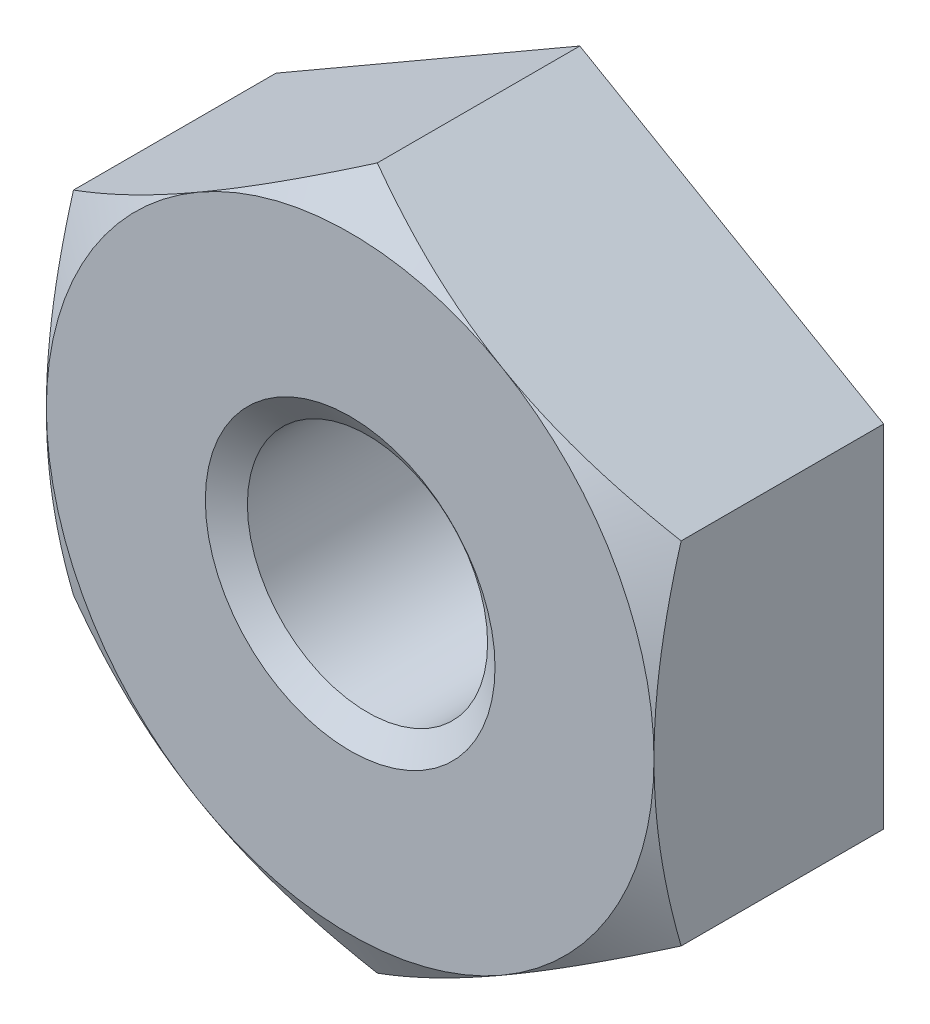
ISO-10303-21;
HEADER;
FILE_DESCRIPTION(('STEP AP214'),'2;1');
FILE_NAME('part.step','',(''),(''),'','','');
FILE_SCHEMA(('AUTOMOTIVE_DESIGN { 1 0 10303 214 1 1 1 1 }'));
ENDSEC;
DATA;
#1=APPLICATION_CONTEXT('core data for automotive mechanical design processes');
#2=APPLICATION_PROTOCOL_DEFINITION('international standard','automotive_design',2000,#1);
#3=PRODUCT_CONTEXT('',#1,'mechanical');
#4=PRODUCT('Part','Part','',(#3));
#5=PRODUCT_RELATED_PRODUCT_CATEGORY('part','',(#4));
#6=PRODUCT_DEFINITION_FORMATION('','',#4);
#7=PRODUCT_DEFINITION_CONTEXT('part definition',#1,'design');
#8=PRODUCT_DEFINITION('design','',#6,#7);
#9=PRODUCT_DEFINITION_SHAPE('','',#8);
#10=(LENGTH_UNIT() NAMED_UNIT(*) SI_UNIT(.MILLI.,.METRE.));
#11=(NAMED_UNIT(*) PLANE_ANGLE_UNIT() SI_UNIT($,.RADIAN.));
#12=(NAMED_UNIT(*) SI_UNIT($,.STERADIAN.) SOLID_ANGLE_UNIT());
#13=UNCERTAINTY_MEASURE_WITH_UNIT(LENGTH_MEASURE(1.E-05),#10,'distance_accuracy_value','');
#14=(GEOMETRIC_REPRESENTATION_CONTEXT(3) GLOBAL_UNCERTAINTY_ASSIGNED_CONTEXT((#13)) GLOBAL_UNIT_ASSIGNED_CONTEXT((#10,
#11,#12)) REPRESENTATION_CONTEXT('',''));
#15=CARTESIAN_POINT('',(0.,0.,0.));
#16=DIRECTION('',(0.,0.,1.));
#17=DIRECTION('',(1.,0.,0.));
#18=AXIS2_PLACEMENT_3D('',#15,#16,#17);
#19=CARTESIAN_POINT('',(0.,0.,0.));
#20=DIRECTION('',(0.,0.,1.));
#21=DIRECTION('',(1.,0.,0.));
#22=AXIS2_PLACEMENT_3D('',#19,#20,#21);
#23=CONICAL_SURFACE('',#22,2.0827999999824,0.959931088625132);
#24=CARTESIAN_POINT('',(0.,0.,-0.248993800587373));
#25=DIRECTION('',(0.,0.,1.));
#26=DIRECTION('',(1.,0.,0.));
#27=AXIS2_PLACEMENT_3D('',#24,#25,#26);
#28=CIRCLE('',#27,1.7272);
#29=CARTESIAN_POINT('',(1.7272,0.,-0.248993800587373));
#30=VERTEX_POINT('',#29);
#31=EDGE_CURVE('E265',#30,#30,#28,.F.);
#32=ORIENTED_EDGE('',*,*,#31,.T.);
#33=EDGE_LOOP('',(#32));
#34=FACE_BOUND('',#33,.T.);
#35=CARTESIAN_POINT('',(0.,0.,0.));
#36=DIRECTION('',(0.,0.,1.));
#37=DIRECTION('',(1.,0.,0.));
#38=AXIS2_PLACEMENT_3D('',#35,#36,#37);
#39=CIRCLE('',#38,2.0827999999824);
#40=CARTESIAN_POINT('',(2.0827999999824,0.,0.));
#41=VERTEX_POINT('',#40);
#42=EDGE_CURVE('E19',#41,#41,#39,.T.);
#43=ORIENTED_EDGE('',*,*,#42,.T.);
#44=EDGE_LOOP('',(#43));
#45=FACE_BOUND('',#44,.T.);
#46=ADVANCED_FACE('F16',(#34,#45),#23,.F.);
#47=CARTESIAN_POINT('',(0.,0.,-3.302));
#48=DIRECTION('',(0.,0.,1.));
#49=DIRECTION('',(1.,0.,0.));
#50=AXIS2_PLACEMENT_3D('',#47,#48,#49);
#51=CYLINDRICAL_SURFACE('',#50,1.7272);
#52=ORIENTED_EDGE('',*,*,#31,.F.);
#53=EDGE_LOOP('',(#52));
#54=FACE_BOUND('',#53,.T.);
#55=CARTESIAN_POINT('',(0.,0.,-3.0276061993959));
#56=DIRECTION('',(0.,0.,-1.));
#57=DIRECTION('',(-1.,0.,0.));
#58=AXIS2_PLACEMENT_3D('',#55,#56,#57);
#59=CIRCLE('',#58,1.72719999994797);
#60=CARTESIAN_POINT('',(-1.72719999994797,0.,-3.0276061993959));
#61=VERTEX_POINT('',#60);
#62=EDGE_CURVE('E95',#61,#61,#59,.T.);
#63=ORIENTED_EDGE('',*,*,#62,.T.);
#64=EDGE_LOOP('',(#63));
#65=FACE_BOUND('',#64,.T.);
#66=ADVANCED_FACE('F274',(#54,#65),#51,.F.);
#67=CARTESIAN_POINT('',(0.,5.04465571207128,0.));
#68=DIRECTION('',(0.,0.,-1.));
#69=DIRECTION('',(-1.,0.,0.));
#70=AXIS2_PLACEMENT_3D('',#67,#68,#69);
#71=PLANE('',#70);
#72=CARTESIAN_POINT('',(0.,0.,0.));
#73=DIRECTION('',(0.,0.,-1.));
#74=DIRECTION('',(-1.,0.,0.));
#75=AXIS2_PLACEMENT_3D('',#72,#73,#74);
#76=CIRCLE('',#75,4.36879999995199);
#77=CARTESIAN_POINT('',(-2.184399999988,-3.78349178403267,-1.38634374029629E-11));
#78=VERTEX_POINT('',#77);
#79=CARTESIAN_POINT('',(-4.36879999997599,0.,-1.38595867138459E-11));
#80=VERTEX_POINT('',#79);
#81=EDGE_CURVE('E106',#78,#80,#76,.T.);
#82=ORIENTED_EDGE('',*,*,#81,.F.);
#83=CARTESIAN_POINT('',(0.,0.,0.));
#84=DIRECTION('',(0.,0.,-1.));
#85=DIRECTION('',(-1.,0.,0.));
#86=AXIS2_PLACEMENT_3D('',#83,#84,#85);
#87=CIRCLE('',#86,4.36879999995199);
#88=CARTESIAN_POINT('',(2.18439999998801,-3.78349178403267,-1.3863037041634E-11));
#89=VERTEX_POINT('',#88);
#90=EDGE_CURVE('E302',#89,#78,#87,.T.);
#91=ORIENTED_EDGE('',*,*,#90,.F.);
#92=CARTESIAN_POINT('',(0.,0.,0.));
#93=DIRECTION('',(0.,0.,-1.));
#94=DIRECTION('',(-1.,0.,0.));
#95=AXIS2_PLACEMENT_3D('',#92,#93,#94);
#96=CIRCLE('',#95,4.36879999995199);
#97=CARTESIAN_POINT('',(4.36879999997599,0.,-1.38591066885676E-11));
#98=VERTEX_POINT('',#97);
#99=EDGE_CURVE('E305',#98,#89,#96,.T.);
#100=ORIENTED_EDGE('',*,*,#99,.F.);
#101=CARTESIAN_POINT('',(0.,0.,0.));
#102=DIRECTION('',(0.,0.,-1.));
#103=DIRECTION('',(-1.,0.,0.));
#104=AXIS2_PLACEMENT_3D('',#101,#102,#103);
#105=CIRCLE('',#104,4.36879999995199);
#106=CARTESIAN_POINT('',(2.184399999988,3.78349178403266,-1.38593949571464E-11));
#107=VERTEX_POINT('',#106);
#108=EDGE_CURVE('E90',#107,#98,#105,.T.);
#109=ORIENTED_EDGE('',*,*,#108,.F.);
#110=CARTESIAN_POINT('',(0.,0.,0.));
#111=DIRECTION('',(0.,0.,-1.));
#112=DIRECTION('',(-1.,0.,0.));
#113=AXIS2_PLACEMENT_3D('',#110,#111,#112);
#114=CIRCLE('',#113,4.36879999995199);
#115=CARTESIAN_POINT('',(-2.18439999998801,3.78349178403266,-1.3859398924521E-11));
#116=VERTEX_POINT('',#115);
#117=EDGE_CURVE('E83',#116,#107,#114,.T.);
#118=ORIENTED_EDGE('',*,*,#117,.F.);
#119=CARTESIAN_POINT('',(0.,0.,0.));
#120=DIRECTION('',(0.,0.,-1.));
#121=DIRECTION('',(-1.,0.,0.));
#122=AXIS2_PLACEMENT_3D('',#119,#120,#121);
#123=CIRCLE('',#122,4.36879999995199);
#124=EDGE_CURVE('E87',#80,#116,#123,.T.);
#125=ORIENTED_EDGE('',*,*,#124,.F.);
#126=EDGE_LOOP('',(#82,#91,#100,#109,#118,#125));
#127=FACE_BOUND('',#126,.T.);
#128=ORIENTED_EDGE('',*,*,#42,.F.);
#129=EDGE_LOOP('',(#128));
#130=FACE_BOUND('',#129,.T.);
#131=ADVANCED_FACE('F85',(#127,#130),#71,.F.);
#132=CARTESIAN_POINT('',(0.,0.,-3.27659999999241));
#133=DIRECTION('',(0.,0.,-1.));
#134=DIRECTION('',(0.,1.,0.));
#135=AXIS2_PLACEMENT_3D('',#132,#133,#134);
#136=CONICAL_SURFACE('',#135,2.0827999999824,0.959931088625132);
#137=CARTESIAN_POINT('',(0.,0.,-3.2766));
#138=DIRECTION('',(0.,0.,1.));
#139=DIRECTION('',(1.,0.,0.));
#140=AXIS2_PLACEMENT_3D('',#137,#138,#139);
#141=CIRCLE('',#140,2.0828);
#142=CARTESIAN_POINT('',(2.0828,0.,-3.2766));
#143=VERTEX_POINT('',#142);
#144=EDGE_CURVE('E105',#143,#143,#141,.F.);
#145=ORIENTED_EDGE('',*,*,#144,.T.);
#146=EDGE_LOOP('',(#145));
#147=FACE_BOUND('',#146,.T.);
#148=ORIENTED_EDGE('',*,*,#62,.F.);
#149=EDGE_LOOP('',(#148));
#150=FACE_BOUND('',#149,.T.);
#151=ADVANCED_FACE('F273',(#147,#150),#136,.F.);
#152=CARTESIAN_POINT('',(0.,0.,-0.392546710145325));
#153=DIRECTION('',(0.,0.,-1.));
#154=DIRECTION('',(-1.,0.,0.));
#155=AXIS2_PLACEMENT_3D('',#152,#153,#154);
#156=CONICAL_SURFACE('',#155,5.04871084626757,1.04719755119651);
#157=CARTESIAN_POINT('',(8.20666976433675E-12,5.04465571207247,-0.390205477320254));
#158=CARTESIAN_POINT('',(0.177809229288232,4.94199750567939,-0.330920865010066));
#159=CARTESIAN_POINT('',(0.357042418773727,4.83851717548069,-0.276605809762697));
#160=CARTESIAN_POINT('',(0.71708872059069,4.63064434620486,-0.180822187766374));
#161=CARTESIAN_POINT('',(0.897889274182464,4.52625909791945,-0.139290097925705));
#162=CARTESIAN_POINT('',(1.1707964230033,4.36869608208412,-0.0882957428393747));
#163=CARTESIAN_POINT('',(1.26211021273951,4.31597604099916,-0.0731753973998228));
#164=CARTESIAN_POINT('',(1.44517494854458,4.21028356650294,-0.0470017642533782));
#165=CARTESIAN_POINT('',(1.53692588304308,4.15731113977185,-0.0359483695012521));
#166=CARTESIAN_POINT('',(1.72120428372451,4.0509179555326,-0.018102845686886));
#167=CARTESIAN_POINT('',(1.81373333592807,3.99749628233501,-0.0113323869758687));
#168=CARTESIAN_POINT('',(1.99897341501282,3.89054787281072,-0.00227159294775038));
#169=CARTESIAN_POINT('',(2.09168447429569,3.83702111777689,1.78550950788678E-05));
#170=CARTESIAN_POINT('',(2.18439999999979,3.78349178405358,-2.77187148644052E-11));
#171=B_SPLINE_CURVE_WITH_KNOTS('',3,(#157,#158,#159,#160,#161,#162,#163,#164,#165,#166,#167,
#168,#169,#170),.UNSPECIFIED.,.F.,.F.,(4,2,2,2,2,2,4),(0.,0.641371870633347,1.27950306646297,
1.59898734514013,1.9184632141466,2.23954287009938,2.56068609584247),.UNSPECIFIED.);
#172=CARTESIAN_POINT('',(0.,5.04465571206758,-0.39020547732336));
#173=VERTEX_POINT('',#172);
#174=EDGE_CURVE('E111',#173,#107,#171,.T.);
#175=ORIENTED_EDGE('',*,*,#174,.F.);
#176=CARTESIAN_POINT('',(-2.18439999999926,3.78349178405215,-2.85851326009804E-11));
#177=CARTESIAN_POINT('',(-2.09168447429558,3.83702111777634,1.78550947729084E-05));
#178=CARTESIAN_POINT('',(-1.99897341501285,3.89054787281053,-0.00227159294782891));
#179=CARTESIAN_POINT('',(-1.81373333592815,3.99749628233513,-0.0113323869757854));
#180=CARTESIAN_POINT('',(-1.7212042837245,4.05091795553264,-0.0181028456868677));
#181=CARTESIAN_POINT('',(-1.53692588304298,4.15731113977187,-0.0359483695012817));
#182=CARTESIAN_POINT('',(-1.44517494854448,4.210283566503,-0.0470017642533901));
#183=CARTESIAN_POINT('',(-1.26211021273937,4.31597604099924,-0.073175397399846));
#184=CARTESIAN_POINT('',(-1.17079642300312,4.36869608208418,-0.088295742839427));
#185=CARTESIAN_POINT('',(-0.897889274182235,4.52625909791968,-0.139290097925711));
#186=CARTESIAN_POINT('',(-0.717088720590531,4.63064434620549,-0.18082218776617));
#187=CARTESIAN_POINT('',(-0.357042418773059,4.83851717548054,-0.276605809763124));
#188=CARTESIAN_POINT('',(-0.177809229286981,4.94199750567805,-0.330920865011341));
#189=CARTESIAN_POINT('',(-5.63908877473904E-12,5.04465571206803,-0.390205477323619));
#190=B_SPLINE_CURVE_WITH_KNOTS('',3,(#176,#177,#178,#179,#180,#181,#182,#183,#184,#185,#186,
#187,#188,#189),.UNSPECIFIED.,.F.,.F.,(4,2,2,2,2,2,4),(0.,0.321143225743273,0.64222288169619,
0.961698750702712,1.28118302937996,1.91931422520983,2.56068609584356),.UNSPECIFIED.);
#191=EDGE_CURVE('E108',#116,#173,#190,.T.);
#192=ORIENTED_EDGE('',*,*,#191,.F.);
#193=ORIENTED_EDGE('',*,*,#117,.T.);
#194=EDGE_LOOP('',(#175,#192,#193));
#195=FACE_BOUND('',#194,.T.);
#196=ADVANCED_FACE('F109',(#195),#156,.T.);
#197=CARTESIAN_POINT('',(0.,0.,-0.392546710145325));
#198=DIRECTION('',(0.,0.,-1.));
#199=DIRECTION('',(-1.,0.,0.));
#200=AXIS2_PLACEMENT_3D('',#197,#198,#199);
#201=CONICAL_SURFACE('',#200,5.04871084626757,1.04719755119651);
#202=CARTESIAN_POINT('',(4.3687999999985,0.,-2.85843252875171E-11));
#203=CARTESIAN_POINT('',(4.36879999999946,0.107058667446668,1.7855094774036E-05));
#204=CARTESIAN_POINT('',(4.36879999999985,0.214112177514335,-0.00227159294782606));
#205=CARTESIAN_POINT('',(4.36880000000014,0.428008996562946,-0.0113323869757761));
#206=CARTESIAN_POINT('',(4.36880000000004,0.53485234295812,-0.0181028456868536));
#207=CARTESIAN_POINT('',(4.36879999999996,0.74763871143662,-0.035948369501255));
#208=CARTESIAN_POINT('',(4.36879999999999,0.853583564898808,-0.0470017642533556));
#209=CARTESIAN_POINT('',(4.36880000000001,1.06496851389117,-0.0731753973997927));
#210=CARTESIAN_POINT('',(4.3688,1.17040859606102,-0.0882957428393628));
#211=CARTESIAN_POINT('',(4.36879999999999,1.48553462773193,-0.139290097925612));
#212=CARTESIAN_POINT('',(4.36879999999999,1.69430512430346,-0.180822187766042));
#213=CARTESIAN_POINT('',(4.3688,2.11005078285341,-0.276605809762935));
#214=CARTESIAN_POINT('',(4.36880000000001,2.31701144324835,-0.330920865011118));
#215=CARTESIAN_POINT('',(4.3688,2.52232785602824,-0.390205477323358));
#216=B_SPLINE_CURVE_WITH_KNOTS('',3,(#202,#203,#204,#205,#206,#207,#208,#209,#210,#211,#212,
#213,#214,#215),.UNSPECIFIED.,.F.,.F.,(4,2,2,2,2,2,4),(0.,0.321143225743155,0.642222881695953,
0.961698750702359,1.28118302937949,1.91931422520913,2.56068609584262),.UNSPECIFIED.);
#217=CARTESIAN_POINT('',(4.36879999999679,2.52232785603379,-0.390205477323355));
#218=VERTEX_POINT('',#217);
#219=EDGE_CURVE('E232',#98,#218,#216,.T.);
#220=ORIENTED_EDGE('',*,*,#219,.T.);
#221=CARTESIAN_POINT('',(2.18439999999926,3.78349178405215,-2.85851872626728E-11));
#222=CARTESIAN_POINT('',(2.27711552570389,3.72996245032963,1.78550947735859E-05));
#223=CARTESIAN_POINT('',(2.36982658498702,3.67643569529612,-0.00227159294782811));
#224=CARTESIAN_POINT('',(2.55506666407201,3.56948728577203,-0.0113323869757848));
#225=CARTESIAN_POINT('',(2.64759571627555,3.51606561257433,-0.0181028456868673));
#226=CARTESIAN_POINT('',(2.83187411695699,3.40967242833497,-0.0359483695012813));
#227=CARTESIAN_POINT('',(2.92362505145551,3.35670000160389,-0.0470017642533895));
#228=CARTESIAN_POINT('',(3.10668978726065,3.25100752710769,-0.0731753973998446));
#229=CARTESIAN_POINT('',(3.19800357699688,3.19828748602274,-0.0882957428394251));
#230=CARTESIAN_POINT('',(3.47091072581776,3.04072447018722,-0.139290097925708));
#231=CARTESIAN_POINT('',(3.65171127940947,2.93633922190142,-0.180822187766166));
#232=CARTESIAN_POINT('',(4.01175758122694,2.72846639262638,-0.276605809763118));
#233=CARTESIAN_POINT('',(4.19099077071302,2.62498606242888,-0.330920865011335));
#234=CARTESIAN_POINT('',(4.36879999999435,2.52232785603889,-0.390205477323611));
#235=B_SPLINE_CURVE_WITH_KNOTS('',3,(#221,#222,#223,#224,#225,#226,#227,#228,#229,#230,#231,
#232,#233,#234),.UNSPECIFIED.,.F.,.F.,(4,2,2,2,2,2,4),(0.,0.321143225743269,0.642222881696183,
0.961698750702702,1.28118302937995,1.91931422520981,2.56068609584353),.UNSPECIFIED.);
#236=EDGE_CURVE('E321',#107,#218,#235,.T.);
#237=ORIENTED_EDGE('',*,*,#236,.F.);
#238=ORIENTED_EDGE('',*,*,#108,.T.);
#239=EDGE_LOOP('',(#220,#237,#238));
#240=FACE_BOUND('',#239,.T.);
#241=ADVANCED_FACE('F202',(#240),#201,.T.);
#242=CARTESIAN_POINT('',(0.,0.,-0.392546710145325));
#243=DIRECTION('',(0.,0.,-1.));
#244=DIRECTION('',(-1.,0.,0.));
#245=AXIS2_PLACEMENT_3D('',#242,#243,#244);
#246=CONICAL_SURFACE('',#245,5.04871084626757,1.04719755119651);
#247=ORIENTED_EDGE('',*,*,#99,.T.);
#248=CARTESIAN_POINT('',(4.36879999999693,-2.52232785604335,-0.390205477320254));
#249=CARTESIAN_POINT('',(4.19099077071356,-2.62498606243064,-0.330920865010067));
#250=CARTESIAN_POINT('',(4.01175758122675,-2.72846639262704,-0.276605809762699));
#251=CARTESIAN_POINT('',(3.65171127940885,-2.93633922190125,-0.180822187766377));
#252=CARTESIAN_POINT('',(3.47091072581746,-3.04072447018732,-0.139290097925709));
#253=CARTESIAN_POINT('',(3.19800357699675,-3.19828748602287,-0.08829574283938));
#254=CARTESIAN_POINT('',(3.10668978726052,-3.25100752710778,-0.0731753973998285));
#255=CARTESIAN_POINT('',(2.92362505145542,-3.35670000160395,-0.0470017642533845));
#256=CARTESIAN_POINT('',(2.83187411695693,-3.40967242833506,-0.0359483695012588));
#257=CARTESIAN_POINT('',(2.64759571627551,-3.51606561257432,-0.0181028456868932));
#258=CARTESIAN_POINT('',(2.55506666407195,-3.56948728577191,-0.0113323869758761));
#259=CARTESIAN_POINT('',(2.3698265849872,-3.6764356952962,-0.0022715929477579));
#260=CARTESIAN_POINT('',(2.27711552570433,-3.72996245033002,1.78550950713345E-05));
#261=CARTESIAN_POINT('',(2.18440000000023,-3.78349178405334,-2.77262165460544E-11));
#262=B_SPLINE_CURVE_WITH_KNOTS('',3,(#248,#249,#250,#251,#252,#253,#254,#255,#256,#257,#258,
#259,#260,#261),.UNSPECIFIED.,.F.,.F.,(4,2,2,2,2,2,4),(0.,0.64137187063334,1.27950306646295,
1.59898734514012,1.91846321414658,2.23954287009935,2.56068609584245),.UNSPECIFIED.);
#263=CARTESIAN_POINT('',(4.36879999999679,-2.52232785603379,-0.390205477323358));
#264=VERTEX_POINT('',#263);
#265=EDGE_CURVE('E212',#264,#89,#262,.T.);
#266=ORIENTED_EDGE('',*,*,#265,.F.);
#267=CARTESIAN_POINT('',(4.3688,-2.52232785602824,-0.390205477323358));
#268=CARTESIAN_POINT('',(4.3688,-2.31701144324836,-0.330920865011126));
#269=CARTESIAN_POINT('',(4.3688,-2.11005078285344,-0.276605809762944));
#270=CARTESIAN_POINT('',(4.3688,-1.69430512430351,-0.18082218776605));
#271=CARTESIAN_POINT('',(4.3688,-1.48553462773197,-0.139290097925616));
#272=CARTESIAN_POINT('',(4.3688,-1.17040859606108,-0.0882957428393747));
#273=CARTESIAN_POINT('',(4.3688,-1.06496851389124,-0.0731753973998092));
#274=CARTESIAN_POINT('',(4.3688,-0.853583564898904,-0.0470017642533602));
#275=CARTESIAN_POINT('',(4.3688,-0.747638711436725,-0.0359483695012432));
#276=CARTESIAN_POINT('',(4.3688,-0.534852342958249,-0.0181028456868852));
#277=CARTESIAN_POINT('',(4.3688,-0.42800899656309,-0.0113323869758678));
#278=CARTESIAN_POINT('',(4.3688,-0.214112177514523,-0.00227159294774813));
#279=CARTESIAN_POINT('',(4.3688,-0.107058667446882,1.78550950819041E-05));
#280=CARTESIAN_POINT('',(4.3688,-2.48974217425888E-13,-2.77182133771352E-11));
#281=B_SPLINE_CURVE_WITH_KNOTS('',3,(#267,#268,#269,#270,#271,#272,#273,#274,#275,#276,#277,
#278,#279,#280),.UNSPECIFIED.,.F.,.F.,(4,2,2,2,2,2,4),(0.,0.641371870633447,1.27950306646307,
1.59898734514017,1.91846321414655,2.2395428700993,2.56068609584239),.UNSPECIFIED.);
#282=EDGE_CURVE('E207',#264,#98,#281,.T.);
#283=ORIENTED_EDGE('',*,*,#282,.T.);
#284=EDGE_LOOP('',(#247,#266,#283));
#285=FACE_BOUND('',#284,.T.);
#286=ADVANCED_FACE('F196',(#285),#246,.T.);
#287=CARTESIAN_POINT('',(0.,0.,-0.392546710145325));
#288=DIRECTION('',(0.,0.,-1.));
#289=DIRECTION('',(-1.,0.,0.));
#290=AXIS2_PLACEMENT_3D('',#287,#288,#289);
#291=CONICAL_SURFACE('',#290,5.04871084626757,1.04719755119651);
#292=CARTESIAN_POINT('',(-8.22546880178279E-12,-5.04465571207248,-0.390205477320255));
#293=CARTESIAN_POINT('',(-0.177809229288249,-4.9419975056794,-0.330920865010069));
#294=CARTESIAN_POINT('',(-0.357042418773743,-4.8385171754807,-0.276605809762701));
#295=CARTESIAN_POINT('',(-0.717088720590704,-4.63064434620487,-0.180822187766379));
#296=CARTESIAN_POINT('',(-0.897889274182477,-4.52625909791946,-0.139290097925711));
#297=CARTESIAN_POINT('',(-1.17079642300331,-4.36869608208413,-0.0882957428393816));
#298=CARTESIAN_POINT('',(-1.26211021273952,-4.31597604099917,-0.07317539739983));
#299=CARTESIAN_POINT('',(-1.44517494854459,-4.21028356650295,-0.0470017642533858));
#300=CARTESIAN_POINT('',(-1.53692588304309,-4.15731113977186,-0.0359483695012599));
#301=CARTESIAN_POINT('',(-1.72120428372452,-4.05091795553261,-0.018102845686894));
#302=CARTESIAN_POINT('',(-1.81373333592807,-3.99749628233502,-0.0113323869758767));
#303=CARTESIAN_POINT('',(-1.99897341501283,-3.89054787281073,-0.00227159294775848));
#304=CARTESIAN_POINT('',(-2.0916844742957,-3.8370211177769,1.78550950706897E-05));
#305=CARTESIAN_POINT('',(-2.18439999999979,-3.78349178405359,-2.7727075568759E-11));
#306=B_SPLINE_CURVE_WITH_KNOTS('',3,(#292,#293,#294,#295,#296,#297,#298,#299,#300,#301,#302,
#303,#304,#305),.UNSPECIFIED.,.F.,.F.,(4,2,2,2,2,2,4),(0.,0.641371870633342,1.27950306646296,
1.59898734514012,1.91846321414658,2.23954287009936,2.56068609584246),.UNSPECIFIED.);
#307=CARTESIAN_POINT('',(0.,-5.04465571206759,-0.390205477323366));
#308=VERTEX_POINT('',#307);
#309=EDGE_CURVE('E180',#308,#78,#306,.T.);
#310=ORIENTED_EDGE('',*,*,#309,.F.);
#311=CARTESIAN_POINT('',(2.18439999999926,-3.78349178405216,-2.85939737462468E-11));
#312=CARTESIAN_POINT('',(2.09168447429559,-3.83702111777635,1.78550947657104E-05));
#313=CARTESIAN_POINT('',(1.99897341501286,-3.89054787281054,-0.0022715929478356));
#314=CARTESIAN_POINT('',(1.81373333592815,-3.99749628233514,-0.0113323869757921));
#315=CARTESIAN_POINT('',(1.7212042837245,-4.05091795553266,-0.0181028456868749));
#316=CARTESIAN_POINT('',(1.53692588304298,-4.15731113977188,-0.0359483695012897));
#317=CARTESIAN_POINT('',(1.44517494854448,-4.21028356650302,-0.0470017642533984));
#318=CARTESIAN_POINT('',(1.26211021273937,-4.31597604099925,-0.0731753973998541));
#319=CARTESIAN_POINT('',(1.17079642300312,-4.36869608208419,-0.0882957428394347));
#320=CARTESIAN_POINT('',(0.897889274182231,-4.52625909791969,-0.139290097925719));
#321=CARTESIAN_POINT('',(0.717088720590527,-4.6306443462055,-0.180822187766178));
#322=CARTESIAN_POINT('',(0.357042418773052,-4.83851717548056,-0.276605809763134));
#323=CARTESIAN_POINT('',(0.177809229286974,-4.94199750567807,-0.330920865011352));
#324=CARTESIAN_POINT('',(5.63068734133847E-12,-5.04465571206804,-0.390205477323629));
#325=B_SPLINE_CURVE_WITH_KNOTS('',3,(#311,#312,#313,#314,#315,#316,#317,#318,#319,#320,#321,
#322,#323,#324),.UNSPECIFIED.,.F.,.F.,(4,2,2,2,2,2,4),(0.,0.321143225743275,0.642222881696194,
0.961698750702719,1.28118302937997,1.91931422520984,2.56068609584357),.UNSPECIFIED.);
#326=EDGE_CURVE('E187',#89,#308,#325,.T.);
#327=ORIENTED_EDGE('',*,*,#326,.F.);
#328=ORIENTED_EDGE('',*,*,#90,.T.);
#329=EDGE_LOOP('',(#310,#327,#328));
#330=FACE_BOUND('',#329,.T.);
#331=ADVANCED_FACE('F192',(#330),#291,.T.);
#332=CARTESIAN_POINT('',(0.,0.,-0.392546710145325));
#333=DIRECTION('',(0.,0.,-1.));
#334=DIRECTION('',(-1.,0.,0.));
#335=AXIS2_PLACEMENT_3D('',#332,#333,#334);
#336=CONICAL_SURFACE('',#335,5.04871084626757,1.04719755119651);
#337=CARTESIAN_POINT('',(-4.36880000000514,-2.52232785602914,-0.390205477320255));
#338=CARTESIAN_POINT('',(-4.36880000000179,-2.31701144324876,-0.330920865010066));
#339=CARTESIAN_POINT('',(-4.36880000000047,-2.11005078285367,-0.276605809762697));
#340=CARTESIAN_POINT('',(-4.36879999999953,-1.69430512430362,-0.180822187766374));
#341=CARTESIAN_POINT('',(-4.36879999999991,-1.48553462773215,-0.139290097925705));
#342=CARTESIAN_POINT('',(-4.36880000000004,-1.17040859606126,-0.0882957428393751));
#343=CARTESIAN_POINT('',(-4.36880000000001,-1.06496851389139,-0.073175397399823));
#344=CARTESIAN_POINT('',(-4.36879999999999,-0.853583564899001,-0.0470017642533785));
#345=CARTESIAN_POINT('',(-4.3688,-0.747638711436796,-0.0359483695012526));
#346=CARTESIAN_POINT('',(-4.3688,-0.534852342958283,-0.0181028456868864));
#347=CARTESIAN_POINT('',(-4.3688,-0.428008996563113,-0.0113323869758689));
#348=CARTESIAN_POINT('',(-4.3688,-0.214112177514531,-0.00227159294775033));
#349=CARTESIAN_POINT('',(-4.3688,-0.107058667446887,1.78550950788831E-05));
#350=CARTESIAN_POINT('',(-4.3688,-2.51110884783552E-13,-2.77192570276055E-11));
#351=B_SPLINE_CURVE_WITH_KNOTS('',3,(#337,#338,#339,#340,#341,#342,#343,#344,#345,#346,#347,
#348,#349,#350),.UNSPECIFIED.,.F.,.F.,(4,2,2,2,2,2,4),(0.,0.641371870633347,1.27950306646297,
1.59898734514013,1.9184632141466,2.23954287009938,2.56068609584247),.UNSPECIFIED.);
#352=CARTESIAN_POINT('',(-4.36879999999679,-2.5223278560338,-0.39020547732336));
#353=VERTEX_POINT('',#352);
#354=EDGE_CURVE('E152',#353,#80,#351,.T.);
#355=ORIENTED_EDGE('',*,*,#354,.F.);
#356=CARTESIAN_POINT('',(-2.18439999999926,-3.78349178405216,-2.85950874511126E-11));
#357=CARTESIAN_POINT('',(-2.2771155257039,-3.72996245032964,1.78550947642622E-05));
#358=CARTESIAN_POINT('',(-2.36982658498702,-3.67643569529613,-0.00227159294783703));
#359=CARTESIAN_POINT('',(-2.55506666407201,-3.56948728577204,-0.0113323869757931));
#360=CARTESIAN_POINT('',(-2.64759571627555,-3.51606561257434,-0.0181028456868754));
#361=CARTESIAN_POINT('',(-2.831874116957,-3.40967242833499,-0.0359483695012891));
#362=CARTESIAN_POINT('',(-2.92362505145552,-3.3567000016039,-0.0470017642533971));
#363=CARTESIAN_POINT('',(-3.10668978726066,-3.2510075271077,-0.0731753973998522));
#364=CARTESIAN_POINT('',(-3.19800357699689,-3.19828748602275,-0.088295742839433));
#365=CARTESIAN_POINT('',(-3.47091072581777,-3.04072447018723,-0.139290097925716));
#366=CARTESIAN_POINT('',(-3.65171127940947,-2.93633922190143,-0.180822187766174));
#367=CARTESIAN_POINT('',(-4.01175758122695,-2.72846639262639,-0.276605809763126));
#368=CARTESIAN_POINT('',(-4.19099077071303,-2.62498606242889,-0.330920865011342));
#369=CARTESIAN_POINT('',(-4.36879999999436,-2.5223278560389,-0.390205477323618));
#370=B_SPLINE_CURVE_WITH_KNOTS('',3,(#356,#357,#358,#359,#360,#361,#362,#363,#364,#365,#366,
#367,#368,#369),.UNSPECIFIED.,.F.,.F.,(4,2,2,2,2,2,4),(0.,0.32114322574327,0.642222881696184,
0.961698750702702,1.28118302937995,1.91931422520981,2.56068609584353),.UNSPECIFIED.);
#371=EDGE_CURVE('E175',#78,#353,#370,.T.);
#372=ORIENTED_EDGE('',*,*,#371,.F.);
#373=ORIENTED_EDGE('',*,*,#81,.T.);
#374=EDGE_LOOP('',(#355,#372,#373));
#375=FACE_BOUND('',#374,.T.);
#376=ADVANCED_FACE('F141',(#375),#336,.T.);
#377=CARTESIAN_POINT('',(0.,0.,-0.392546710145325));
#378=DIRECTION('',(0.,0.,-1.));
#379=DIRECTION('',(-1.,0.,0.));
#380=AXIS2_PLACEMENT_3D('',#377,#378,#379);
#381=CONICAL_SURFACE('',#380,5.04871084626757,1.04719755119651);
#382=ORIENTED_EDGE('',*,*,#124,.T.);
#383=CARTESIAN_POINT('',(-4.36879999999693,2.52232785604333,-0.390205477320251));
#384=CARTESIAN_POINT('',(-4.19099077071356,2.62498606243062,-0.330920865010062));
#385=CARTESIAN_POINT('',(-4.01175758122675,2.72846639262703,-0.276605809762694));
#386=CARTESIAN_POINT('',(-3.65171127940885,2.93633922190124,-0.180822187766371));
#387=CARTESIAN_POINT('',(-3.47091072581746,3.0407244701873,-0.139290097925702));
#388=CARTESIAN_POINT('',(-3.19800357699675,3.19828748602286,-0.0882957428393733));
#389=CARTESIAN_POINT('',(-3.10668978726051,3.25100752710776,-0.0731753973998217));
#390=CARTESIAN_POINT('',(-2.92362505145541,3.35670000160394,-0.0470017642533776));
#391=CARTESIAN_POINT('',(-2.83187411695693,3.40967242833505,-0.0359483695012518));
#392=CARTESIAN_POINT('',(-2.64759571627551,3.51606561257431,-0.018102845686886));
#393=CARTESIAN_POINT('',(-2.55506666407195,3.5694872857719,-0.0113323869758688));
#394=CARTESIAN_POINT('',(-2.36982658498719,3.67643569529618,-0.00227159294775043));
#395=CARTESIAN_POINT('',(-2.27711552570432,3.72996245033,1.78550950788369E-05));
#396=CARTESIAN_POINT('',(-2.18440000000023,3.78349178405332,-2.77188066397181E-11));
#397=B_SPLINE_CURVE_WITH_KNOTS('',3,(#383,#384,#385,#386,#387,#388,#389,#390,#391,#392,#393,
#394,#395,#396),.UNSPECIFIED.,.F.,.F.,(4,2,2,2,2,2,4),(0.,0.641371870633342,1.27950306646296,
1.59898734514012,1.91846321414658,2.23954287009936,2.56068609584246),.UNSPECIFIED.);
#398=CARTESIAN_POINT('',(-4.36879999999679,2.52232785603748,-0.390205477324423));
#399=VERTEX_POINT('',#398);
#400=EDGE_CURVE('E100',#399,#116,#397,.T.);
#401=ORIENTED_EDGE('',*,*,#400,.F.);
#402=CARTESIAN_POINT('',(-4.3687999999985,0.,-2.85855081796301E-11));
#403=CARTESIAN_POINT('',(-4.36879999999946,0.107058667446706,1.78550947729605E-05));
#404=CARTESIAN_POINT('',(-4.36879999999986,0.214112177514412,-0.0022715929478288));
#405=CARTESIAN_POINT('',(-4.36880000000014,0.428008996563099,-0.0113323869757854));
#406=CARTESIAN_POINT('',(-4.36880000000004,0.534852342958312,-0.0181028456868678));
#407=CARTESIAN_POINT('',(-4.36879999999996,0.747638711436888,-0.0359483695012819));
#408=CARTESIAN_POINT('',(-4.36879999999999,0.853583564899114,-0.0470017642533901));
#409=CARTESIAN_POINT('',(-4.36880000000001,1.06496851389155,-0.0731753973998454));
#410=CARTESIAN_POINT('',(-4.3688,1.17040859606143,-0.088295742839426));
#411=CARTESIAN_POINT('',(-4.36879999999999,1.48553462773245,-0.139290097925709));
#412=CARTESIAN_POINT('',(-4.3688,1.69430512430406,-0.180822187766167));
#413=CARTESIAN_POINT('',(-4.3688,2.11005078285416,-0.27660580976312));
#414=CARTESIAN_POINT('',(-4.36880000000001,2.31701144324916,-0.330920865011337));
#415=CARTESIAN_POINT('',(-4.3688,2.52232785602912,-0.390205477323613));
#416=B_SPLINE_CURVE_WITH_KNOTS('',3,(#402,#403,#404,#405,#406,#407,#408,#409,#410,#411,#412,
#413,#414,#415),.UNSPECIFIED.,.F.,.F.,(4,2,2,2,2,2,4),(0.,0.32114322574327,0.642222881696185,
0.961698750702705,1.28118302937995,1.91931422520982,2.56068609584354),.UNSPECIFIED.);
#417=EDGE_CURVE('E103',#80,#399,#416,.T.);
#418=ORIENTED_EDGE('',*,*,#417,.F.);
#419=EDGE_LOOP('',(#382,#401,#418));
#420=FACE_BOUND('',#419,.T.);
#421=ADVANCED_FACE('F98',(#420),#381,.T.);
#422=CARTESIAN_POINT('',(0.,0.,-25.0375057290932));
#423=DIRECTION('',(0.,0.,1.));
#424=DIRECTION('',(1.,0.,0.));
#425=AXIS2_PLACEMENT_3D('',#422,#423,#424);
#426=CYLINDRICAL_SURFACE('',#425,2.0828);
#427=ORIENTED_EDGE('',*,*,#144,.F.);
#428=EDGE_LOOP('',(#427));
#429=FACE_BOUND('',#428,.T.);
#430=CARTESIAN_POINT('',(0.,0.,-3.302));
#431=DIRECTION('',(0.,0.,1.));
#432=DIRECTION('',(1.,0.,0.));
#433=AXIS2_PLACEMENT_3D('',#430,#431,#432);
#434=CIRCLE('',#433,2.0828);
#435=CARTESIAN_POINT('',(2.0828,0.,-3.302));
#436=VERTEX_POINT('',#435);
#437=EDGE_CURVE('E153',#436,#436,#434,.T.);
#438=ORIENTED_EDGE('',*,*,#437,.F.);
#439=EDGE_LOOP('',(#438));
#440=FACE_BOUND('',#439,.T.);
#441=ADVANCED_FACE('F140',(#429,#440),#426,.F.);
#442=CARTESIAN_POINT('',(0.,5.04465571207128,-3.302));
#443=DIRECTION('',(-0.500000000000002,0.866025403784437,0.));
#444=DIRECTION('',(-0.866025403784437,-0.500000000000002,0.));
#445=AXIS2_PLACEMENT_3D('',#442,#443,#444);
#446=PLANE('',#445);
#447=DIRECTION('',(0.,0.,1.));
#448=VECTOR('',#447,1.);
#449=CARTESIAN_POINT('',(0.,5.04465571207128,-3.302));
#450=LINE('',#449,#448);
#451=CARTESIAN_POINT('',(0.,5.04465571207128,-3.302));
#452=VERTEX_POINT('',#451);
#453=EDGE_CURVE('E114',#452,#173,#450,.T.);
#454=ORIENTED_EDGE('',*,*,#453,.F.);
#455=DIRECTION('',(0.866025403784437,0.500000000000002,0.));
#456=VECTOR('',#455,1.);
#457=CARTESIAN_POINT('',(-4.3688,2.52232785603563,-3.302));
#458=LINE('',#457,#456);
#459=CARTESIAN_POINT('',(-4.3688,2.52232785603563,-3.302));
#460=VERTEX_POINT('',#459);
#461=EDGE_CURVE('E238',#460,#452,#458,.T.);
#462=ORIENTED_EDGE('',*,*,#461,.F.);
#463=DIRECTION('',(0.,0.,1.));
#464=VECTOR('',#463,1.);
#465=CARTESIAN_POINT('',(-4.3688,2.52232785603563,-3.302));
#466=LINE('',#465,#464);
#467=EDGE_CURVE('E119',#399,#460,#466,.F.);
#468=ORIENTED_EDGE('',*,*,#467,.F.);
#469=ORIENTED_EDGE('',*,*,#400,.T.);
#470=ORIENTED_EDGE('',*,*,#191,.T.);
#471=EDGE_LOOP('',(#454,#462,#468,#469,#470));
#472=FACE_BOUND('',#471,.T.);
#473=ADVANCED_FACE('F116',(#472),#446,.T.);
#474=CARTESIAN_POINT('',(4.3688,2.52232785603563,-3.302));
#475=DIRECTION('',(0.500000000000002,0.866025403784438,0.));
#476=DIRECTION('',(-0.866025403784438,0.500000000000002,0.));
#477=AXIS2_PLACEMENT_3D('',#474,#475,#476);
#478=PLANE('',#477);
#479=DIRECTION('',(0.,0.,1.));
#480=VECTOR('',#479,1.);
#481=CARTESIAN_POINT('',(4.3688,2.52232785603565,-3.302));
#482=LINE('',#481,#480);
#483=CARTESIAN_POINT('',(4.3688,2.52232785603565,-3.302));
#484=VERTEX_POINT('',#483);
#485=EDGE_CURVE('E224',#218,#484,#482,.F.);
#486=ORIENTED_EDGE('',*,*,#485,.T.);
#487=DIRECTION('',(0.866025403784438,-0.500000000000002,0.));
#488=VECTOR('',#487,1.);
#489=CARTESIAN_POINT('',(0.,5.04465571207128,-3.302));
#490=LINE('',#489,#488);
#491=EDGE_CURVE('E241',#452,#484,#490,.T.);
#492=ORIENTED_EDGE('',*,*,#491,.F.);
#493=ORIENTED_EDGE('',*,*,#453,.T.);
#494=ORIENTED_EDGE('',*,*,#174,.T.);
#495=ORIENTED_EDGE('',*,*,#236,.T.);
#496=EDGE_LOOP('',(#486,#492,#493,#494,#495));
#497=FACE_BOUND('',#496,.T.);
#498=ADVANCED_FACE('F311',(#497),#478,.T.);
#499=CARTESIAN_POINT('',(4.3688,2.52232785603563,-3.302));
#500=DIRECTION('',(-1.,0.,0.));
#501=DIRECTION('',(0.,0.,1.));
#502=AXIS2_PLACEMENT_3D('',#499,#500,#501);
#503=PLANE('',#502);
#504=DIRECTION('',(0.,0.,1.));
#505=VECTOR('',#504,1.);
#506=CARTESIAN_POINT('',(4.3688,-2.52232785603565,-3.302));
#507=LINE('',#506,#505);
#508=CARTESIAN_POINT('',(4.3688,-2.52232785603565,-3.302));
#509=VERTEX_POINT('',#508);
#510=EDGE_CURVE('E217',#509,#264,#507,.T.);
#511=ORIENTED_EDGE('',*,*,#510,.F.);
#512=DIRECTION('',(0.,1.,0.));
#513=VECTOR('',#512,1.);
#514=CARTESIAN_POINT('',(4.3688,5.04465571207128,-3.302));
#515=LINE('',#514,#513);
#516=EDGE_CURVE('E253',#484,#509,#515,.F.);
#517=ORIENTED_EDGE('',*,*,#516,.F.);
#518=ORIENTED_EDGE('',*,*,#485,.F.);
#519=ORIENTED_EDGE('',*,*,#219,.F.);
#520=ORIENTED_EDGE('',*,*,#282,.F.);
#521=EDGE_LOOP('',(#511,#517,#518,#519,#520));
#522=FACE_BOUND('',#521,.T.);
#523=ADVANCED_FACE('F316',(#522),#503,.F.);
#524=CARTESIAN_POINT('',(0.,-5.04465571207129,-3.302));
#525=DIRECTION('',(0.500000000000002,-0.866025403784438,0.));
#526=DIRECTION('',(0.866025403784438,0.500000000000002,0.));
#527=AXIS2_PLACEMENT_3D('',#524,#525,#526);
#528=PLANE('',#527);
#529=DIRECTION('',(0.,0.,1.));
#530=VECTOR('',#529,1.);
#531=CARTESIAN_POINT('',(0.,-5.04465571207129,-3.302));
#532=LINE('',#531,#530);
#533=CARTESIAN_POINT('',(0.,-5.04465571207129,-3.302));
#534=VERTEX_POINT('',#533);
#535=EDGE_CURVE('E186',#534,#308,#532,.T.);
#536=ORIENTED_EDGE('',*,*,#535,.F.);
#537=DIRECTION('',(-0.866025403784438,-0.500000000000002,0.));
#538=VECTOR('',#537,1.);
#539=CARTESIAN_POINT('',(4.3688,-2.52232785603565,-3.302));
#540=LINE('',#539,#538);
#541=EDGE_CURVE('E248',#509,#534,#540,.T.);
#542=ORIENTED_EDGE('',*,*,#541,.F.);
#543=ORIENTED_EDGE('',*,*,#510,.T.);
#544=ORIENTED_EDGE('',*,*,#265,.T.);
#545=ORIENTED_EDGE('',*,*,#326,.T.);
#546=EDGE_LOOP('',(#536,#542,#543,#544,#545));
#547=FACE_BOUND('',#546,.T.);
#548=ADVANCED_FACE('F171',(#547),#528,.T.);
#549=CARTESIAN_POINT('',(-4.3688,-2.52232785603565,-3.302));
#550=DIRECTION('',(-0.500000000000001,-0.866025403784438,0.));
#551=DIRECTION('',(0.866025403784438,-0.500000000000001,0.));
#552=AXIS2_PLACEMENT_3D('',#549,#550,#551);
#553=PLANE('',#552);
#554=DIRECTION('',(0.,0.,1.));
#555=VECTOR('',#554,1.);
#556=CARTESIAN_POINT('',(-4.3688,-2.52232785603565,-3.302));
#557=LINE('',#556,#555);
#558=CARTESIAN_POINT('',(-4.3688,-2.52232785603565,-3.302));
#559=VERTEX_POINT('',#558);
#560=EDGE_CURVE('E34',#559,#353,#557,.T.);
#561=ORIENTED_EDGE('',*,*,#560,.F.);
#562=DIRECTION('',(-0.866025403784438,0.500000000000001,0.));
#563=VECTOR('',#562,1.);
#564=CARTESIAN_POINT('',(0.,-5.04465571207129,-3.302));
#565=LINE('',#564,#563);
#566=EDGE_CURVE('E25',#534,#559,#565,.T.);
#567=ORIENTED_EDGE('',*,*,#566,.F.);
#568=ORIENTED_EDGE('',*,*,#535,.T.);
#569=ORIENTED_EDGE('',*,*,#309,.T.);
#570=ORIENTED_EDGE('',*,*,#371,.T.);
#571=EDGE_LOOP('',(#561,#567,#568,#569,#570));
#572=FACE_BOUND('',#571,.T.);
#573=ADVANCED_FACE('F165',(#572),#553,.T.);
#574=CARTESIAN_POINT('',(-4.3688,2.52232785603563,-3.302));
#575=DIRECTION('',(-1.,0.,0.));
#576=DIRECTION('',(0.,0.,1.));
#577=AXIS2_PLACEMENT_3D('',#574,#575,#576);
#578=PLANE('',#577);
#579=ORIENTED_EDGE('',*,*,#467,.T.);
#580=DIRECTION('',(0.,1.,0.));
#581=VECTOR('',#580,1.);
#582=CARTESIAN_POINT('',(-4.3688,5.04465571207128,-3.302));
#583=LINE('',#582,#581);
#584=EDGE_CURVE('E11',#559,#460,#583,.T.);
#585=ORIENTED_EDGE('',*,*,#584,.F.);
#586=ORIENTED_EDGE('',*,*,#560,.T.);
#587=ORIENTED_EDGE('',*,*,#354,.T.);
#588=ORIENTED_EDGE('',*,*,#417,.T.);
#589=EDGE_LOOP('',(#579,#585,#586,#587,#588));
#590=FACE_BOUND('',#589,.T.);
#591=ADVANCED_FACE('F159',(#590),#578,.T.);
#592=CARTESIAN_POINT('',(0.,5.04465571207128,-3.302));
#593=DIRECTION('',(0.,0.,-1.));
#594=DIRECTION('',(-1.,0.,0.));
#595=AXIS2_PLACEMENT_3D('',#592,#593,#594);
#596=PLANE('',#595);
#597=ORIENTED_EDGE('',*,*,#566,.T.);
#598=ORIENTED_EDGE('',*,*,#584,.T.);
#599=ORIENTED_EDGE('',*,*,#461,.T.);
#600=ORIENTED_EDGE('',*,*,#491,.T.);
#601=ORIENTED_EDGE('',*,*,#516,.T.);
#602=ORIENTED_EDGE('',*,*,#541,.T.);
#603=EDGE_LOOP('',(#597,#598,#599,#600,#601,#602));
#604=FACE_BOUND('',#603,.T.);
#605=ORIENTED_EDGE('',*,*,#437,.T.);
#606=EDGE_LOOP('',(#605));
#607=FACE_BOUND('',#606,.T.);
#608=ADVANCED_FACE('F164',(#604,#607),#596,.T.);
#609=CLOSED_SHELL('',(#46,#66,#131,#151,#196,#241,#286,#331,#376,#421,#441,#473,#498,#523,#548,
#573,#591,#608));
#610=MANIFOLD_SOLID_BREP('B1',#609);
#611=ADVANCED_BREP_SHAPE_REPRESENTATION('',(#18,#610),#14);
#612=SHAPE_DEFINITION_REPRESENTATION(#9,#611);
ENDSEC;
END-ISO-10303-21;
